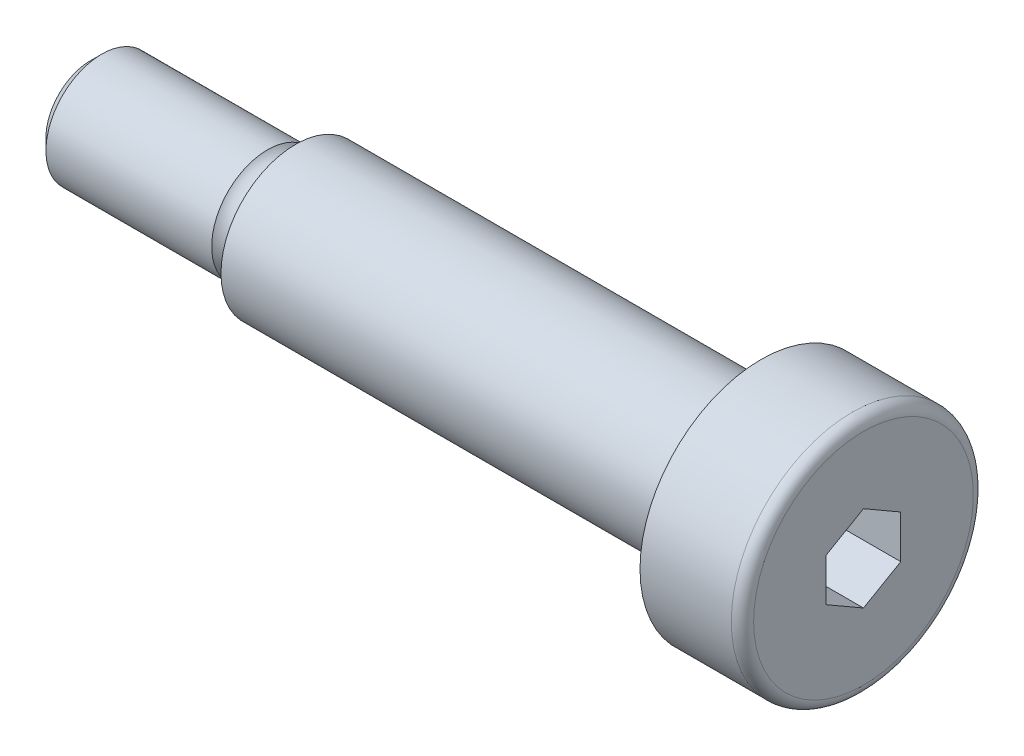
ISO-10303-21;
HEADER;
FILE_DESCRIPTION(('STEP AP214'),'2;1');
FILE_NAME('part.step','',(''),(''),'','','');
FILE_SCHEMA(('AUTOMOTIVE_DESIGN { 1 0 10303 214 1 1 1 1 }'));
ENDSEC;
DATA;
#1=APPLICATION_CONTEXT('core data for automotive mechanical design processes');
#2=APPLICATION_PROTOCOL_DEFINITION('international standard','automotive_design',2000,#1);
#3=PRODUCT_CONTEXT('',#1,'mechanical');
#4=PRODUCT('Part','Part','',(#3));
#5=PRODUCT_RELATED_PRODUCT_CATEGORY('part','',(#4));
#6=PRODUCT_DEFINITION_FORMATION('','',#4);
#7=PRODUCT_DEFINITION_CONTEXT('part definition',#1,'design');
#8=PRODUCT_DEFINITION('design','',#6,#7);
#9=PRODUCT_DEFINITION_SHAPE('','',#8);
#10=(LENGTH_UNIT() NAMED_UNIT(*) SI_UNIT(.MILLI.,.METRE.));
#11=(NAMED_UNIT(*) PLANE_ANGLE_UNIT() SI_UNIT($,.RADIAN.));
#12=(NAMED_UNIT(*) SI_UNIT($,.STERADIAN.) SOLID_ANGLE_UNIT());
#13=UNCERTAINTY_MEASURE_WITH_UNIT(LENGTH_MEASURE(1.E-05),#10,'distance_accuracy_value','');
#14=(GEOMETRIC_REPRESENTATION_CONTEXT(3) GLOBAL_UNCERTAINTY_ASSIGNED_CONTEXT((#13)) GLOBAL_UNIT_ASSIGNED_CONTEXT((#10,
#11,#12)) REPRESENTATION_CONTEXT('',''));
#15=CARTESIAN_POINT('',(0.,0.,0.));
#16=DIRECTION('',(0.,0.,1.));
#17=DIRECTION('',(1.,0.,0.));
#18=AXIS2_PLACEMENT_3D('',#15,#16,#17);
#19=CARTESIAN_POINT('',(0.,0.,0.));
#20=DIRECTION('',(-1.,0.,0.));
#21=DIRECTION('',(0.,0.,1.));
#22=AXIS2_PLACEMENT_3D('',#19,#20,#21);
#23=PLANE('',#22);
#24=DIRECTION('',(0.,-0.5,-0.866025403784439));
#25=VECTOR('',#24,1.);
#26=CARTESIAN_POINT('',(0.,-1.15470053837925,2.));
#27=LINE('',#26,#25);
#28=CARTESIAN_POINT('',(0.,-1.15470053837925,2.));
#29=VERTEX_POINT('',#28);
#30=CARTESIAN_POINT('',(0.,-2.3094010767585,0.));
#31=VERTEX_POINT('',#30);
#32=EDGE_CURVE('E123',#29,#31,#27,.T.);
#33=ORIENTED_EDGE('',*,*,#32,.F.);
#34=DIRECTION('',(0.,-1.,0.));
#35=VECTOR('',#34,1.);
#36=CARTESIAN_POINT('',(0.,1.15470053837925,2.));
#37=LINE('',#36,#35);
#38=CARTESIAN_POINT('',(0.,1.15470053837925,2.));
#39=VERTEX_POINT('',#38);
#40=EDGE_CURVE('E49',#39,#29,#37,.T.);
#41=ORIENTED_EDGE('',*,*,#40,.F.);
#42=DIRECTION('',(0.,-0.5,0.866025403784439));
#43=VECTOR('',#42,1.);
#44=CARTESIAN_POINT('',(0.,2.3094010767585,0.));
#45=LINE('',#44,#43);
#46=CARTESIAN_POINT('',(0.,2.3094010767585,0.));
#47=VERTEX_POINT('',#46);
#48=EDGE_CURVE('E133',#47,#39,#45,.T.);
#49=ORIENTED_EDGE('',*,*,#48,.F.);
#50=DIRECTION('',(0.,0.5,0.866025403784439));
#51=VECTOR('',#50,1.);
#52=CARTESIAN_POINT('',(0.,1.15470053837925,-2.));
#53=LINE('',#52,#51);
#54=CARTESIAN_POINT('',(0.,1.15470053837925,-2.));
#55=VERTEX_POINT('',#54);
#56=EDGE_CURVE('E131',#55,#47,#53,.T.);
#57=ORIENTED_EDGE('',*,*,#56,.F.);
#58=DIRECTION('',(0.,1.,0.));
#59=VECTOR('',#58,1.);
#60=CARTESIAN_POINT('',(0.,-1.15470053837925,-2.));
#61=LINE('',#60,#59);
#62=CARTESIAN_POINT('',(0.,-1.15470053837925,-2.));
#63=VERTEX_POINT('',#62);
#64=EDGE_CURVE('E97',#63,#55,#61,.T.);
#65=ORIENTED_EDGE('',*,*,#64,.F.);
#66=DIRECTION('',(0.,0.5,-0.866025403784438));
#67=VECTOR('',#66,1.);
#68=CARTESIAN_POINT('',(0.,-2.3094010767585,0.));
#69=LINE('',#68,#67);
#70=EDGE_CURVE('E127',#31,#63,#69,.T.);
#71=ORIENTED_EDGE('',*,*,#70,.F.);
#72=EDGE_LOOP('',(#33,#41,#49,#57,#65,#71));
#73=FACE_BOUND('',#72,.T.);
#74=CARTESIAN_POINT('',(0.,0.,0.));
#75=DIRECTION('',(-1.,0.,0.));
#76=DIRECTION('',(0.,0.,1.));
#77=AXIS2_PLACEMENT_3D('',#74,#75,#76);
#78=CIRCLE('',#77,5.9);
#79=CARTESIAN_POINT('',(0.,0.,5.9));
#80=VERTEX_POINT('',#79);
#81=EDGE_CURVE('E154',#80,#80,#78,.F.);
#82=ORIENTED_EDGE('',*,*,#81,.T.);
#83=EDGE_LOOP('',(#82));
#84=FACE_BOUND('',#83,.T.);
#85=ADVANCED_FACE('F34',(#73,#84),#23,.F.);
#86=CARTESIAN_POINT('',(0.,0.,0.));
#87=DIRECTION('',(-1.,0.,0.));
#88=DIRECTION('',(0.,0.,1.));
#89=AXIS2_PLACEMENT_3D('',#86,#87,#88);
#90=CYLINDRICAL_SURFACE('',#89,6.5);
#91=CARTESIAN_POINT('',(-0.6,0.,0.));
#92=DIRECTION('',(-1.,0.,0.));
#93=DIRECTION('',(0.,0.,1.));
#94=AXIS2_PLACEMENT_3D('',#91,#92,#93);
#95=CIRCLE('',#94,6.5);
#96=CARTESIAN_POINT('',(-0.6,0.,6.5));
#97=VERTEX_POINT('',#96);
#98=EDGE_CURVE('E151',#97,#97,#95,.T.);
#99=ORIENTED_EDGE('',*,*,#98,.T.);
#100=EDGE_LOOP('',(#99));
#101=FACE_BOUND('',#100,.T.);
#102=CARTESIAN_POINT('',(-5.5,0.,0.));
#103=DIRECTION('',(-1.,0.,0.));
#104=DIRECTION('',(0.,0.,1.));
#105=AXIS2_PLACEMENT_3D('',#102,#103,#104);
#106=CIRCLE('',#105,6.5);
#107=CARTESIAN_POINT('',(-5.5,0.,6.5));
#108=VERTEX_POINT('',#107);
#109=EDGE_CURVE('E148',#108,#108,#106,.T.);
#110=ORIENTED_EDGE('',*,*,#109,.F.);
#111=EDGE_LOOP('',(#110));
#112=FACE_BOUND('',#111,.T.);
#113=ADVANCED_FACE('F174',(#101,#112),#90,.T.);
#114=CARTESIAN_POINT('',(-5.5,6.5,0.));
#115=DIRECTION('',(1.,0.,0.));
#116=DIRECTION('',(0.,0.,-1.));
#117=AXIS2_PLACEMENT_3D('',#114,#115,#116);
#118=PLANE('',#117);
#119=CARTESIAN_POINT('',(-5.5,0.,0.));
#120=DIRECTION('',(-1.,0.,0.));
#121=DIRECTION('',(0.,0.,1.));
#122=AXIS2_PLACEMENT_3D('',#119,#120,#121);
#123=CIRCLE('',#122,4.);
#124=CARTESIAN_POINT('',(-5.5,0.,4.));
#125=VERTEX_POINT('',#124);
#126=EDGE_CURVE('E145',#125,#125,#123,.T.);
#127=ORIENTED_EDGE('',*,*,#126,.F.);
#128=EDGE_LOOP('',(#127));
#129=FACE_BOUND('',#128,.T.);
#130=ORIENTED_EDGE('',*,*,#109,.T.);
#131=EDGE_LOOP('',(#130));
#132=FACE_BOUND('',#131,.T.);
#133=ADVANCED_FACE('F180',(#129,#132),#118,.F.);
#134=CARTESIAN_POINT('',(0.,0.,0.));
#135=DIRECTION('',(-1.,0.,0.));
#136=DIRECTION('',(0.,0.,1.));
#137=AXIS2_PLACEMENT_3D('',#134,#135,#136);
#138=CYLINDRICAL_SURFACE('',#137,4.);
#139=CARTESIAN_POINT('',(-30.5,0.,0.));
#140=DIRECTION('',(-1.,0.,0.));
#141=DIRECTION('',(0.,0.,1.));
#142=AXIS2_PLACEMENT_3D('',#139,#140,#141);
#143=CIRCLE('',#142,4.);
#144=CARTESIAN_POINT('',(-30.5,0.,4.));
#145=VERTEX_POINT('',#144);
#146=EDGE_CURVE('E137',#145,#145,#143,.T.);
#147=ORIENTED_EDGE('',*,*,#146,.F.);
#148=EDGE_LOOP('',(#147));
#149=FACE_BOUND('',#148,.T.);
#150=ORIENTED_EDGE('',*,*,#126,.T.);
#151=EDGE_LOOP('',(#150));
#152=FACE_BOUND('',#151,.T.);
#153=ADVANCED_FACE('F197',(#149,#152),#138,.T.);
#154=CARTESIAN_POINT('',(-30.5,4.,0.));
#155=DIRECTION('',(1.,0.,0.));
#156=DIRECTION('',(0.,0.,-1.));
#157=AXIS2_PLACEMENT_3D('',#154,#155,#156);
#158=PLANE('',#157);
#159=CARTESIAN_POINT('',(-30.5,0.,0.));
#160=DIRECTION('',(1.,0.,0.));
#161=DIRECTION('',(0.,0.,-1.));
#162=AXIS2_PLACEMENT_3D('',#159,#160,#161);
#163=CIRCLE('',#162,3.);
#164=CARTESIAN_POINT('',(-30.5,0.,-3.));
#165=VERTEX_POINT('',#164);
#166=EDGE_CURVE('E240',#165,#165,#163,.T.);
#167=ORIENTED_EDGE('',*,*,#166,.T.);
#168=EDGE_LOOP('',(#167));
#169=FACE_BOUND('',#168,.T.);
#170=ORIENTED_EDGE('',*,*,#146,.T.);
#171=EDGE_LOOP('',(#170));
#172=FACE_BOUND('',#171,.T.);
#173=ADVANCED_FACE('F189',(#169,#172),#158,.F.);
#174=CARTESIAN_POINT('',(-0.6,0.,0.));
#175=DIRECTION('',(-1.,0.,0.));
#176=DIRECTION('',(0.,0.,1.));
#177=AXIS2_PLACEMENT_3D('',#174,#175,#176);
#178=TOROIDAL_SURFACE('',#177,5.9,0.6);
#179=ORIENTED_EDGE('',*,*,#81,.F.);
#180=EDGE_LOOP('',(#179));
#181=FACE_BOUND('',#180,.T.);
#182=ORIENTED_EDGE('',*,*,#98,.F.);
#183=EDGE_LOOP('',(#182));
#184=FACE_BOUND('',#183,.T.);
#185=ADVANCED_FACE('F186',(#181,#184),#178,.T.);
#186=CARTESIAN_POINT('',(-5.,1.15470053837925,2.));
#187=DIRECTION('',(0.,0.,1.));
#188=DIRECTION('',(1.,0.,0.));
#189=AXIS2_PLACEMENT_3D('',#186,#187,#188);
#190=PLANE('',#189);
#191=ORIENTED_EDGE('',*,*,#40,.T.);
#192=DIRECTION('',(1.,0.,0.));
#193=VECTOR('',#192,1.);
#194=CARTESIAN_POINT('',(-5.,-1.15470053837925,2.));
#195=LINE('',#194,#193);
#196=CARTESIAN_POINT('',(-5.,-1.15470053837925,2.));
#197=VERTEX_POINT('',#196);
#198=EDGE_CURVE('E79',#197,#29,#195,.T.);
#199=ORIENTED_EDGE('',*,*,#198,.F.);
#200=DIRECTION('',(0.,-1.,0.));
#201=VECTOR('',#200,1.);
#202=CARTESIAN_POINT('',(-5.,1.15470053837925,2.));
#203=LINE('',#202,#201);
#204=CARTESIAN_POINT('',(-5.,1.15470053837925,2.));
#205=VERTEX_POINT('',#204);
#206=EDGE_CURVE('E135',#205,#197,#203,.T.);
#207=ORIENTED_EDGE('',*,*,#206,.F.);
#208=DIRECTION('',(1.,0.,0.));
#209=VECTOR('',#208,1.);
#210=CARTESIAN_POINT('',(-5.,1.15470053837925,2.));
#211=LINE('',#210,#209);
#212=EDGE_CURVE('E57',#205,#39,#211,.T.);
#213=ORIENTED_EDGE('',*,*,#212,.T.);
#214=EDGE_LOOP('',(#191,#199,#207,#213));
#215=FACE_BOUND('',#214,.T.);
#216=ADVANCED_FACE('F188',(#215),#190,.F.);
#217=CARTESIAN_POINT('',(-5.,2.3094010767585,0.));
#218=DIRECTION('',(0.,0.866025403784439,0.5));
#219=DIRECTION('',(0.,-0.5,0.866025403784439));
#220=AXIS2_PLACEMENT_3D('',#217,#218,#219);
#221=PLANE('',#220);
#222=ORIENTED_EDGE('',*,*,#48,.T.);
#223=ORIENTED_EDGE('',*,*,#212,.F.);
#224=DIRECTION('',(0.,-0.5,0.866025403784439));
#225=VECTOR('',#224,1.);
#226=CARTESIAN_POINT('',(-5.,2.3094010767585,0.));
#227=LINE('',#226,#225);
#228=CARTESIAN_POINT('',(-5.,2.3094010767585,0.));
#229=VERTEX_POINT('',#228);
#230=EDGE_CURVE('E109',#229,#205,#227,.T.);
#231=ORIENTED_EDGE('',*,*,#230,.F.);
#232=DIRECTION('',(1.,0.,0.));
#233=VECTOR('',#232,1.);
#234=CARTESIAN_POINT('',(-5.,2.3094010767585,0.));
#235=LINE('',#234,#233);
#236=EDGE_CURVE('E101',#229,#47,#235,.T.);
#237=ORIENTED_EDGE('',*,*,#236,.T.);
#238=EDGE_LOOP('',(#222,#223,#231,#237));
#239=FACE_BOUND('',#238,.T.);
#240=ADVANCED_FACE('F195',(#239),#221,.F.);
#241=CARTESIAN_POINT('',(-5.,1.15470053837925,-2.));
#242=DIRECTION('',(0.,0.866025403784439,-0.5));
#243=DIRECTION('',(0.,0.5,0.866025403784439));
#244=AXIS2_PLACEMENT_3D('',#241,#242,#243);
#245=PLANE('',#244);
#246=ORIENTED_EDGE('',*,*,#56,.T.);
#247=ORIENTED_EDGE('',*,*,#236,.F.);
#248=DIRECTION('',(0.,0.5,0.866025403784439));
#249=VECTOR('',#248,1.);
#250=CARTESIAN_POINT('',(-5.,1.15470053837925,-2.));
#251=LINE('',#250,#249);
#252=CARTESIAN_POINT('',(-5.,1.15470053837925,-2.));
#253=VERTEX_POINT('',#252);
#254=EDGE_CURVE('E105',#253,#229,#251,.T.);
#255=ORIENTED_EDGE('',*,*,#254,.F.);
#256=DIRECTION('',(1.,0.,0.));
#257=VECTOR('',#256,1.);
#258=CARTESIAN_POINT('',(-5.,1.15470053837925,-2.));
#259=LINE('',#258,#257);
#260=EDGE_CURVE('E90',#253,#55,#259,.T.);
#261=ORIENTED_EDGE('',*,*,#260,.T.);
#262=EDGE_LOOP('',(#246,#247,#255,#261));
#263=FACE_BOUND('',#262,.T.);
#264=ADVANCED_FACE('F106',(#263),#245,.F.);
#265=CARTESIAN_POINT('',(-5.,-1.15470053837925,-2.));
#266=DIRECTION('',(0.,0.,-1.));
#267=DIRECTION('',(-1.,0.,0.));
#268=AXIS2_PLACEMENT_3D('',#265,#266,#267);
#269=PLANE('',#268);
#270=ORIENTED_EDGE('',*,*,#64,.T.);
#271=ORIENTED_EDGE('',*,*,#260,.F.);
#272=DIRECTION('',(0.,1.,0.));
#273=VECTOR('',#272,1.);
#274=CARTESIAN_POINT('',(-5.,-1.15470053837925,-2.));
#275=LINE('',#274,#273);
#276=CARTESIAN_POINT('',(-5.,-1.15470053837925,-2.));
#277=VERTEX_POINT('',#276);
#278=EDGE_CURVE('E94',#277,#253,#275,.T.);
#279=ORIENTED_EDGE('',*,*,#278,.F.);
#280=DIRECTION('',(1.,0.,0.));
#281=VECTOR('',#280,1.);
#282=CARTESIAN_POINT('',(-5.,-1.15470053837925,-2.));
#283=LINE('',#282,#281);
#284=EDGE_CURVE('E102',#277,#63,#283,.T.);
#285=ORIENTED_EDGE('',*,*,#284,.T.);
#286=EDGE_LOOP('',(#270,#271,#279,#285));
#287=FACE_BOUND('',#286,.T.);
#288=ADVANCED_FACE('F92',(#287),#269,.F.);
#289=CARTESIAN_POINT('',(-5.,-2.3094010767585,0.));
#290=DIRECTION('',(0.,-0.866025403784438,-0.5));
#291=DIRECTION('',(0.,0.5,-0.866025403784439));
#292=AXIS2_PLACEMENT_3D('',#289,#290,#291);
#293=PLANE('',#292);
#294=ORIENTED_EDGE('',*,*,#70,.T.);
#295=ORIENTED_EDGE('',*,*,#284,.F.);
#296=DIRECTION('',(0.,0.5,-0.866025403784438));
#297=VECTOR('',#296,1.);
#298=CARTESIAN_POINT('',(-5.,-2.3094010767585,0.));
#299=LINE('',#298,#297);
#300=CARTESIAN_POINT('',(-5.,-2.3094010767585,0.));
#301=VERTEX_POINT('',#300);
#302=EDGE_CURVE('E115',#301,#277,#299,.T.);
#303=ORIENTED_EDGE('',*,*,#302,.F.);
#304=DIRECTION('',(1.,0.,0.));
#305=VECTOR('',#304,1.);
#306=CARTESIAN_POINT('',(-5.,-2.3094010767585,0.));
#307=LINE('',#306,#305);
#308=EDGE_CURVE('E140',#301,#31,#307,.T.);
#309=ORIENTED_EDGE('',*,*,#308,.T.);
#310=EDGE_LOOP('',(#294,#295,#303,#309));
#311=FACE_BOUND('',#310,.T.);
#312=ADVANCED_FACE('F218',(#311),#293,.F.);
#313=CARTESIAN_POINT('',(-5.,-1.15470053837925,2.));
#314=DIRECTION('',(0.,-0.866025403784439,0.5));
#315=DIRECTION('',(0.,-0.5,-0.866025403784439));
#316=AXIS2_PLACEMENT_3D('',#313,#314,#315);
#317=PLANE('',#316);
#318=ORIENTED_EDGE('',*,*,#32,.T.);
#319=ORIENTED_EDGE('',*,*,#308,.F.);
#320=DIRECTION('',(0.,-0.5,-0.866025403784439));
#321=VECTOR('',#320,1.);
#322=CARTESIAN_POINT('',(-5.,-1.15470053837925,2.));
#323=LINE('',#322,#321);
#324=EDGE_CURVE('E117',#197,#301,#323,.T.);
#325=ORIENTED_EDGE('',*,*,#324,.F.);
#326=ORIENTED_EDGE('',*,*,#198,.T.);
#327=EDGE_LOOP('',(#318,#319,#325,#326));
#328=FACE_BOUND('',#327,.T.);
#329=ADVANCED_FACE('F215',(#328),#317,.F.);
#330=CARTESIAN_POINT('',(-5.,0.,0.));
#331=DIRECTION('',(1.,0.,0.));
#332=DIRECTION('',(0.,0.,-1.));
#333=AXIS2_PLACEMENT_3D('',#330,#331,#332);
#334=PLANE('',#333);
#335=ORIENTED_EDGE('',*,*,#206,.T.);
#336=ORIENTED_EDGE('',*,*,#324,.T.);
#337=ORIENTED_EDGE('',*,*,#302,.T.);
#338=ORIENTED_EDGE('',*,*,#278,.T.);
#339=ORIENTED_EDGE('',*,*,#254,.T.);
#340=ORIENTED_EDGE('',*,*,#230,.T.);
#341=EDGE_LOOP('',(#335,#336,#337,#338,#339,#340));
#342=FACE_BOUND('',#341,.T.);
#343=ADVANCED_FACE('F112',(#342),#334,.T.);
#344=CARTESIAN_POINT('',(-31.25,0.,0.));
#345=DIRECTION('',(1.,0.,0.));
#346=DIRECTION('',(0.,0.,-1.));
#347=AXIS2_PLACEMENT_3D('',#344,#345,#346);
#348=TOROIDAL_SURFACE('',#347,3.66143782776615,1.);
#349=CARTESIAN_POINT('',(-32.,0.,0.));
#350=DIRECTION('',(1.,0.,0.));
#351=DIRECTION('',(0.,0.,-1.));
#352=AXIS2_PLACEMENT_3D('',#349,#350,#351);
#353=CIRCLE('',#352,3.);
#354=CARTESIAN_POINT('',(-32.,0.,-3.));
#355=VERTEX_POINT('',#354);
#356=EDGE_CURVE('E124',#355,#355,#353,.T.);
#357=ORIENTED_EDGE('',*,*,#356,.T.);
#358=EDGE_LOOP('',(#357));
#359=FACE_BOUND('',#358,.T.);
#360=ORIENTED_EDGE('',*,*,#166,.F.);
#361=EDGE_LOOP('',(#360));
#362=FACE_BOUND('',#361,.T.);
#363=ADVANCED_FACE('F170',(#359,#362),#348,.F.);
#364=CARTESIAN_POINT('',(-41.5,3.,0.));
#365=DIRECTION('',(1.,0.,0.));
#366=DIRECTION('',(0.,0.,-1.));
#367=AXIS2_PLACEMENT_3D('',#364,#365,#366);
#368=PLANE('',#367);
#369=CARTESIAN_POINT('',(-41.5,0.,0.));
#370=DIRECTION('',(1.,0.,0.));
#371=DIRECTION('',(0.,0.,-1.));
#372=AXIS2_PLACEMENT_3D('',#369,#370,#371);
#373=CIRCLE('',#372,2.39999999999999);
#374=CARTESIAN_POINT('',(-41.5,0.,-2.39999999999999));
#375=VERTEX_POINT('',#374);
#376=EDGE_CURVE('E42',#375,#375,#373,.F.);
#377=ORIENTED_EDGE('',*,*,#376,.T.);
#378=EDGE_LOOP('',(#377));
#379=FACE_BOUND('',#378,.T.);
#380=ADVANCED_FACE('F159',(#379),#368,.F.);
#381=CARTESIAN_POINT('',(-41.5,0.,0.));
#382=DIRECTION('',(1.,0.,0.));
#383=DIRECTION('',(0.,0.,-1.));
#384=AXIS2_PLACEMENT_3D('',#381,#382,#383);
#385=CONICAL_SURFACE('',#384,2.39999999999999,0.785398163397452);
#386=CARTESIAN_POINT('',(-40.9,0.,0.));
#387=DIRECTION('',(1.,0.,0.));
#388=DIRECTION('',(0.,0.,-1.));
#389=AXIS2_PLACEMENT_3D('',#386,#387,#388);
#390=CIRCLE('',#389,3.);
#391=CARTESIAN_POINT('',(-40.9,0.,-3.));
#392=VERTEX_POINT('',#391);
#393=EDGE_CURVE('E11',#392,#392,#390,.T.);
#394=ORIENTED_EDGE('',*,*,#393,.F.);
#395=EDGE_LOOP('',(#394));
#396=FACE_BOUND('',#395,.T.);
#397=ORIENTED_EDGE('',*,*,#376,.F.);
#398=EDGE_LOOP('',(#397));
#399=FACE_BOUND('',#398,.T.);
#400=ADVANCED_FACE('F36',(#396,#399),#385,.T.);
#401=CARTESIAN_POINT('',(0.,0.,0.));
#402=DIRECTION('',(-1.,0.,0.));
#403=DIRECTION('',(0.,0.,1.));
#404=AXIS2_PLACEMENT_3D('',#401,#402,#403);
#405=CYLINDRICAL_SURFACE('',#404,3.);
#406=ORIENTED_EDGE('',*,*,#393,.T.);
#407=EDGE_LOOP('',(#406));
#408=FACE_BOUND('',#407,.T.);
#409=ORIENTED_EDGE('',*,*,#356,.F.);
#410=EDGE_LOOP('',(#409));
#411=FACE_BOUND('',#410,.T.);
#412=ADVANCED_FACE('F162',(#408,#411),#405,.T.);
#413=CLOSED_SHELL('',(#85,#113,#133,#153,#173,#185,#216,#240,#264,#288,#312,#329,#343,#363,#380,
#400,#412));
#414=MANIFOLD_SOLID_BREP('B2',#413);
#415=ADVANCED_BREP_SHAPE_REPRESENTATION('',(#18,#414),#14);
#416=SHAPE_DEFINITION_REPRESENTATION(#9,#415);
ENDSEC;
END-ISO-10303-21;
